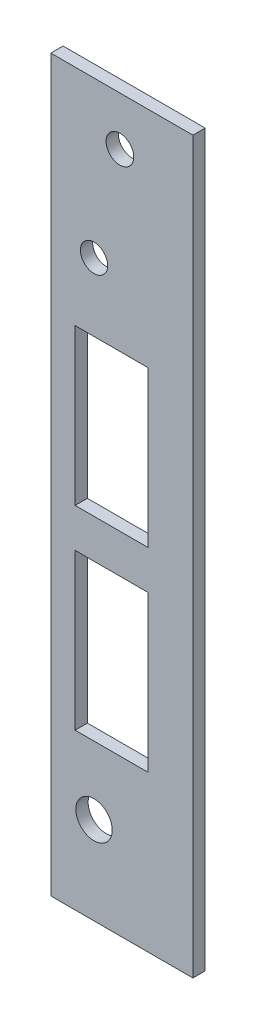
ISO-10303-21;
HEADER;
FILE_DESCRIPTION(('STEP AP214'),'2;1');
FILE_NAME('part.step','',(''),(''),'','','');
FILE_SCHEMA(('AUTOMOTIVE_DESIGN { 1 0 10303 214 1 1 1 1 }'));
ENDSEC;
DATA;
#1=APPLICATION_CONTEXT('core data for automotive mechanical design processes');
#2=APPLICATION_PROTOCOL_DEFINITION('international standard','automotive_design',2000,#1);
#3=PRODUCT_CONTEXT('',#1,'mechanical');
#4=PRODUCT('Part','Part','',(#3));
#5=PRODUCT_RELATED_PRODUCT_CATEGORY('part','',(#4));
#6=PRODUCT_DEFINITION_FORMATION('','',#4);
#7=PRODUCT_DEFINITION_CONTEXT('part definition',#1,'design');
#8=PRODUCT_DEFINITION('design','',#6,#7);
#9=PRODUCT_DEFINITION_SHAPE('','',#8);
#10=(LENGTH_UNIT() NAMED_UNIT(*) SI_UNIT(.MILLI.,.METRE.));
#11=(NAMED_UNIT(*) PLANE_ANGLE_UNIT() SI_UNIT($,.RADIAN.));
#12=(NAMED_UNIT(*) SI_UNIT($,.STERADIAN.) SOLID_ANGLE_UNIT());
#13=UNCERTAINTY_MEASURE_WITH_UNIT(LENGTH_MEASURE(1.E-05),#10,'distance_accuracy_value','');
#14=(GEOMETRIC_REPRESENTATION_CONTEXT(3) GLOBAL_UNCERTAINTY_ASSIGNED_CONTEXT((#13)) GLOBAL_UNIT_ASSIGNED_CONTEXT((#10,
#11,#12)) REPRESENTATION_CONTEXT('',''));
#15=CARTESIAN_POINT('',(0.,0.,0.));
#16=DIRECTION('',(0.,0.,1.));
#17=DIRECTION('',(1.,0.,0.));
#18=AXIS2_PLACEMENT_3D('',#15,#16,#17);
#19=CARTESIAN_POINT('',(0.,0.,1.6002));
#20=DIRECTION('',(1.,0.,0.));
#21=DIRECTION('',(0.,1.,0.));
#22=AXIS2_PLACEMENT_3D('',#19,#20,#21);
#23=PLANE('',#22);
#24=DIRECTION('',(0.,-1.,0.));
#25=VECTOR('',#24,1.);
#26=CARTESIAN_POINT('',(0.,0.,0.));
#27=LINE('',#26,#25);
#28=CARTESIAN_POINT('',(0.,0.,0.));
#29=VERTEX_POINT('',#28);
#30=CARTESIAN_POINT('',(0.,-95.25,0.));
#31=VERTEX_POINT('',#30);
#32=EDGE_CURVE('E176',#29,#31,#27,.T.);
#33=ORIENTED_EDGE('',*,*,#32,.T.);
#34=DIRECTION('',(0.,0.,-1.));
#35=VECTOR('',#34,1.);
#36=CARTESIAN_POINT('',(0.,-95.25,1.6002));
#37=LINE('',#36,#35);
#38=CARTESIAN_POINT('',(0.,-95.25,1.6002));
#39=VERTEX_POINT('',#38);
#40=EDGE_CURVE('E203',#39,#31,#37,.T.);
#41=ORIENTED_EDGE('',*,*,#40,.F.);
#42=DIRECTION('',(0.,-1.,0.));
#43=VECTOR('',#42,1.);
#44=CARTESIAN_POINT('',(0.,0.,1.6002));
#45=LINE('',#44,#43);
#46=CARTESIAN_POINT('',(0.,0.,1.6002));
#47=VERTEX_POINT('',#46);
#48=EDGE_CURVE('E185',#47,#39,#45,.T.);
#49=ORIENTED_EDGE('',*,*,#48,.F.);
#50=DIRECTION('',(0.,0.,-1.));
#51=VECTOR('',#50,1.);
#52=CARTESIAN_POINT('',(0.,0.,1.6002));
#53=LINE('',#52,#51);
#54=EDGE_CURVE('E194',#47,#29,#53,.T.);
#55=ORIENTED_EDGE('',*,*,#54,.T.);
#56=EDGE_LOOP('',(#33,#41,#49,#55));
#57=FACE_BOUND('',#56,.T.);
#58=ADVANCED_FACE('F26',(#57),#23,.F.);
#59=CARTESIAN_POINT('',(0.,-95.25,1.6002));
#60=DIRECTION('',(0.,1.,0.));
#61=DIRECTION('',(0.,0.,1.));
#62=AXIS2_PLACEMENT_3D('',#59,#60,#61);
#63=PLANE('',#62);
#64=DIRECTION('',(1.,0.,0.));
#65=VECTOR('',#64,1.);
#66=CARTESIAN_POINT('',(0.,-95.25,0.));
#67=LINE('',#66,#65);
#68=CARTESIAN_POINT('',(18.542,-95.25,0.));
#69=VERTEX_POINT('',#68);
#70=EDGE_CURVE('E179',#31,#69,#67,.T.);
#71=ORIENTED_EDGE('',*,*,#70,.T.);
#72=DIRECTION('',(0.,0.,-1.));
#73=VECTOR('',#72,1.);
#74=CARTESIAN_POINT('',(18.542,-95.25,1.6002));
#75=LINE('',#74,#73);
#76=CARTESIAN_POINT('',(18.542,-95.25,1.6002));
#77=VERTEX_POINT('',#76);
#78=EDGE_CURVE('E200',#77,#69,#75,.T.);
#79=ORIENTED_EDGE('',*,*,#78,.F.);
#80=DIRECTION('',(1.,0.,0.));
#81=VECTOR('',#80,1.);
#82=CARTESIAN_POINT('',(0.,-95.25,1.6002));
#83=LINE('',#82,#81);
#84=EDGE_CURVE('E188',#39,#77,#83,.T.);
#85=ORIENTED_EDGE('',*,*,#84,.F.);
#86=ORIENTED_EDGE('',*,*,#40,.T.);
#87=EDGE_LOOP('',(#71,#79,#85,#86));
#88=FACE_BOUND('',#87,.T.);
#89=ADVANCED_FACE('F246',(#88),#63,.F.);
#90=CARTESIAN_POINT('',(18.542,0.,1.6002));
#91=DIRECTION('',(-1.,0.,0.));
#92=DIRECTION('',(0.,-1.,0.));
#93=AXIS2_PLACEMENT_3D('',#90,#91,#92);
#94=PLANE('',#93);
#95=DIRECTION('',(0.,1.,0.));
#96=VECTOR('',#95,1.);
#97=CARTESIAN_POINT('',(18.542,0.,0.));
#98=LINE('',#97,#96);
#99=CARTESIAN_POINT('',(18.542,0.,0.));
#100=VERTEX_POINT('',#99);
#101=EDGE_CURVE('E181',#69,#100,#98,.T.);
#102=ORIENTED_EDGE('',*,*,#101,.T.);
#103=DIRECTION('',(0.,0.,-1.));
#104=VECTOR('',#103,1.);
#105=CARTESIAN_POINT('',(18.542,0.,1.6002));
#106=LINE('',#105,#104);
#107=CARTESIAN_POINT('',(18.542,0.,1.6002));
#108=VERTEX_POINT('',#107);
#109=EDGE_CURVE('E197',#108,#100,#106,.T.);
#110=ORIENTED_EDGE('',*,*,#109,.F.);
#111=DIRECTION('',(0.,1.,0.));
#112=VECTOR('',#111,1.);
#113=CARTESIAN_POINT('',(18.542,0.,1.6002));
#114=LINE('',#113,#112);
#115=EDGE_CURVE('E190',#77,#108,#114,.T.);
#116=ORIENTED_EDGE('',*,*,#115,.F.);
#117=ORIENTED_EDGE('',*,*,#78,.T.);
#118=EDGE_LOOP('',(#102,#110,#116,#117));
#119=FACE_BOUND('',#118,.T.);
#120=ADVANCED_FACE('F251',(#119),#94,.F.);
#121=CARTESIAN_POINT('',(0.,0.,1.6002));
#122=DIRECTION('',(0.,-1.,0.));
#123=DIRECTION('',(0.,0.,-1.));
#124=AXIS2_PLACEMENT_3D('',#121,#122,#123);
#125=PLANE('',#124);
#126=DIRECTION('',(-1.,0.,0.));
#127=VECTOR('',#126,1.);
#128=CARTESIAN_POINT('',(0.,0.,0.));
#129=LINE('',#128,#127);
#130=EDGE_CURVE('E183',#100,#29,#129,.T.);
#131=ORIENTED_EDGE('',*,*,#130,.T.);
#132=ORIENTED_EDGE('',*,*,#54,.F.);
#133=DIRECTION('',(-1.,0.,0.));
#134=VECTOR('',#133,1.);
#135=CARTESIAN_POINT('',(0.,0.,1.6002));
#136=LINE('',#135,#134);
#137=EDGE_CURVE('E192',#108,#47,#136,.T.);
#138=ORIENTED_EDGE('',*,*,#137,.F.);
#139=ORIENTED_EDGE('',*,*,#109,.T.);
#140=EDGE_LOOP('',(#131,#132,#138,#139));
#141=FACE_BOUND('',#140,.T.);
#142=ADVANCED_FACE('F266',(#141),#125,.F.);
#143=CARTESIAN_POINT('',(0.,-95.25,1.6002));
#144=DIRECTION('',(0.,0.,1.));
#145=DIRECTION('',(1.,0.,0.));
#146=AXIS2_PLACEMENT_3D('',#143,#144,#145);
#147=PLANE('',#146);
#148=DIRECTION('',(0.,-1.,0.));
#149=VECTOR('',#148,1.);
#150=CARTESIAN_POINT('',(3.175,-54.61,1.6002));
#151=LINE('',#150,#149);
#152=CARTESIAN_POINT('',(3.175,-54.61,1.6002));
#153=VERTEX_POINT('',#152);
#154=CARTESIAN_POINT('',(3.175,-74.93,1.6002));
#155=VERTEX_POINT('',#154);
#156=EDGE_CURVE('E40',#153,#155,#151,.T.);
#157=ORIENTED_EDGE('',*,*,#156,.F.);
#158=DIRECTION('',(-1.,0.,0.));
#159=VECTOR('',#158,1.);
#160=CARTESIAN_POINT('',(3.175,-54.61,1.6002));
#161=LINE('',#160,#159);
#162=CARTESIAN_POINT('',(12.7,-54.61,1.6002));
#163=VERTEX_POINT('',#162);
#164=EDGE_CURVE('E133',#163,#153,#161,.T.);
#165=ORIENTED_EDGE('',*,*,#164,.F.);
#166=DIRECTION('',(0.,1.,0.));
#167=VECTOR('',#166,1.);
#168=CARTESIAN_POINT('',(12.7,-54.61,1.6002));
#169=LINE('',#168,#167);
#170=CARTESIAN_POINT('',(12.7,-74.93,1.6002));
#171=VERTEX_POINT('',#170);
#172=EDGE_CURVE('E117',#171,#163,#169,.T.);
#173=ORIENTED_EDGE('',*,*,#172,.F.);
#174=DIRECTION('',(1.,0.,0.));
#175=VECTOR('',#174,1.);
#176=CARTESIAN_POINT('',(3.175,-74.93,1.6002));
#177=LINE('',#176,#175);
#178=EDGE_CURVE('E126',#155,#171,#177,.T.);
#179=ORIENTED_EDGE('',*,*,#178,.F.);
#180=EDGE_LOOP('',(#157,#165,#173,#179));
#181=FACE_BOUND('',#180,.T.);
#182=DIRECTION('',(0.,-1.,0.));
#183=VECTOR('',#182,1.);
#184=CARTESIAN_POINT('',(3.175,-29.21,1.6002));
#185=LINE('',#184,#183);
#186=CARTESIAN_POINT('',(3.175,-29.21,1.6002));
#187=VERTEX_POINT('',#186);
#188=CARTESIAN_POINT('',(3.175,-49.53,1.6002));
#189=VERTEX_POINT('',#188);
#190=EDGE_CURVE('E140',#187,#189,#185,.T.);
#191=ORIENTED_EDGE('',*,*,#190,.F.);
#192=DIRECTION('',(-1.,0.,0.));
#193=VECTOR('',#192,1.);
#194=CARTESIAN_POINT('',(3.175,-29.21,1.6002));
#195=LINE('',#194,#193);
#196=CARTESIAN_POINT('',(12.7,-29.21,1.6002));
#197=VERTEX_POINT('',#196);
#198=EDGE_CURVE('E150',#197,#187,#195,.T.);
#199=ORIENTED_EDGE('',*,*,#198,.F.);
#200=DIRECTION('',(0.,1.,0.));
#201=VECTOR('',#200,1.);
#202=CARTESIAN_POINT('',(12.7,-29.21,1.6002));
#203=LINE('',#202,#201);
#204=CARTESIAN_POINT('',(12.7,-49.53,1.6002));
#205=VERTEX_POINT('',#204);
#206=EDGE_CURVE('E147',#205,#197,#203,.T.);
#207=ORIENTED_EDGE('',*,*,#206,.F.);
#208=DIRECTION('',(1.,0.,0.));
#209=VECTOR('',#208,1.);
#210=CARTESIAN_POINT('',(3.175,-49.53,1.6002));
#211=LINE('',#210,#209);
#212=EDGE_CURVE('E144',#189,#205,#211,.T.);
#213=ORIENTED_EDGE('',*,*,#212,.F.);
#214=EDGE_LOOP('',(#191,#199,#207,#213));
#215=FACE_BOUND('',#214,.T.);
#216=CARTESIAN_POINT('',(5.63879999999999,-83.82,1.6002));
#217=DIRECTION('',(0.,0.,1.));
#218=DIRECTION('',(1.,0.,0.));
#219=AXIS2_PLACEMENT_3D('',#216,#217,#218);
#220=CIRCLE('',#219,2.3749);
#221=CARTESIAN_POINT('',(8.01369999999999,-83.82,1.6002));
#222=VERTEX_POINT('',#221);
#223=EDGE_CURVE('E156',#222,#222,#220,.T.);
#224=ORIENTED_EDGE('',*,*,#223,.F.);
#225=EDGE_LOOP('',(#224));
#226=FACE_BOUND('',#225,.T.);
#227=CARTESIAN_POINT('',(5.6388,-20.32,1.6002));
#228=DIRECTION('',(0.,0.,1.));
#229=DIRECTION('',(1.,0.,0.));
#230=AXIS2_PLACEMENT_3D('',#227,#228,#229);
#231=CIRCLE('',#230,1.778);
#232=CARTESIAN_POINT('',(7.4168,-20.32,1.6002));
#233=VERTEX_POINT('',#232);
#234=EDGE_CURVE('E166',#233,#233,#231,.T.);
#235=ORIENTED_EDGE('',*,*,#234,.F.);
#236=EDGE_LOOP('',(#235));
#237=FACE_BOUND('',#236,.T.);
#238=CARTESIAN_POINT('',(9.01700000000001,-6.34999999999999,1.6002));
#239=DIRECTION('',(0.,0.,1.));
#240=DIRECTION('',(1.,0.,0.));
#241=AXIS2_PLACEMENT_3D('',#238,#239,#240);
#242=CIRCLE('',#241,1.8034);
#243=CARTESIAN_POINT('',(10.8204,-6.34999999999999,1.6002));
#244=VERTEX_POINT('',#243);
#245=EDGE_CURVE('E170',#244,#244,#242,.T.);
#246=ORIENTED_EDGE('',*,*,#245,.F.);
#247=EDGE_LOOP('',(#246));
#248=FACE_BOUND('',#247,.T.);
#249=ORIENTED_EDGE('',*,*,#48,.T.);
#250=ORIENTED_EDGE('',*,*,#84,.T.);
#251=ORIENTED_EDGE('',*,*,#115,.T.);
#252=ORIENTED_EDGE('',*,*,#137,.T.);
#253=EDGE_LOOP('',(#249,#250,#251,#252));
#254=FACE_BOUND('',#253,.T.);
#255=ADVANCED_FACE('F130',(#181,#215,#226,#237,#248,#254),#147,.T.);
#256=CARTESIAN_POINT('',(0.,-95.25,0.));
#257=DIRECTION('',(0.,0.,1.));
#258=DIRECTION('',(1.,0.,0.));
#259=AXIS2_PLACEMENT_3D('',#256,#257,#258);
#260=PLANE('',#259);
#261=DIRECTION('',(-1.,0.,0.));
#262=VECTOR('',#261,1.);
#263=CARTESIAN_POINT('',(0.,-54.61,0.));
#264=LINE('',#263,#262);
#265=CARTESIAN_POINT('',(12.7,-54.61,0.));
#266=VERTEX_POINT('',#265);
#267=CARTESIAN_POINT('',(3.175,-54.61,0.));
#268=VERTEX_POINT('',#267);
#269=EDGE_CURVE('E33',#266,#268,#264,.T.);
#270=ORIENTED_EDGE('',*,*,#269,.T.);
#271=DIRECTION('',(0.,-1.,0.));
#272=VECTOR('',#271,1.);
#273=CARTESIAN_POINT('',(3.175,-95.25,0.));
#274=LINE('',#273,#272);
#275=CARTESIAN_POINT('',(3.175,-74.93,0.));
#276=VERTEX_POINT('',#275);
#277=EDGE_CURVE('E11',#268,#276,#274,.T.);
#278=ORIENTED_EDGE('',*,*,#277,.T.);
#279=DIRECTION('',(1.,0.,0.));
#280=VECTOR('',#279,1.);
#281=CARTESIAN_POINT('',(0.,-74.93,0.));
#282=LINE('',#281,#280);
#283=CARTESIAN_POINT('',(12.7,-74.93,0.));
#284=VERTEX_POINT('',#283);
#285=EDGE_CURVE('E222',#276,#284,#282,.T.);
#286=ORIENTED_EDGE('',*,*,#285,.T.);
#287=DIRECTION('',(0.,1.,0.));
#288=VECTOR('',#287,1.);
#289=CARTESIAN_POINT('',(12.7,-95.25,0.));
#290=LINE('',#289,#288);
#291=EDGE_CURVE('E120',#284,#266,#290,.T.);
#292=ORIENTED_EDGE('',*,*,#291,.T.);
#293=EDGE_LOOP('',(#270,#278,#286,#292));
#294=FACE_BOUND('',#293,.T.);
#295=DIRECTION('',(-1.,0.,0.));
#296=VECTOR('',#295,1.);
#297=CARTESIAN_POINT('',(0.,-29.21,0.));
#298=LINE('',#297,#296);
#299=CARTESIAN_POINT('',(12.7,-29.21,0.));
#300=VERTEX_POINT('',#299);
#301=CARTESIAN_POINT('',(3.175,-29.21,0.));
#302=VERTEX_POINT('',#301);
#303=EDGE_CURVE('E216',#300,#302,#298,.T.);
#304=ORIENTED_EDGE('',*,*,#303,.T.);
#305=DIRECTION('',(0.,-1.,0.));
#306=VECTOR('',#305,1.);
#307=CARTESIAN_POINT('',(3.17500000000001,-95.25,0.));
#308=LINE('',#307,#306);
#309=CARTESIAN_POINT('',(3.175,-49.53,0.));
#310=VERTEX_POINT('',#309);
#311=EDGE_CURVE('E219',#302,#310,#308,.T.);
#312=ORIENTED_EDGE('',*,*,#311,.T.);
#313=DIRECTION('',(1.,0.,0.));
#314=VECTOR('',#313,1.);
#315=CARTESIAN_POINT('',(0.,-49.53,0.));
#316=LINE('',#315,#314);
#317=CARTESIAN_POINT('',(12.7,-49.53,0.));
#318=VERTEX_POINT('',#317);
#319=EDGE_CURVE('E206',#310,#318,#316,.T.);
#320=ORIENTED_EDGE('',*,*,#319,.T.);
#321=DIRECTION('',(0.,1.,0.));
#322=VECTOR('',#321,1.);
#323=CARTESIAN_POINT('',(12.7,-95.25,0.));
#324=LINE('',#323,#322);
#325=EDGE_CURVE('E213',#318,#300,#324,.T.);
#326=ORIENTED_EDGE('',*,*,#325,.T.);
#327=EDGE_LOOP('',(#304,#312,#320,#326));
#328=FACE_BOUND('',#327,.T.);
#329=CARTESIAN_POINT('',(5.63879999999999,-83.82,0.));
#330=DIRECTION('',(0.,0.,1.));
#331=DIRECTION('',(1.,0.,0.));
#332=AXIS2_PLACEMENT_3D('',#329,#330,#331);
#333=CIRCLE('',#332,2.3749);
#334=CARTESIAN_POINT('',(8.01369999999999,-83.82,0.));
#335=VERTEX_POINT('',#334);
#336=EDGE_CURVE('E165',#335,#335,#333,.T.);
#337=ORIENTED_EDGE('',*,*,#336,.T.);
#338=EDGE_LOOP('',(#337));
#339=FACE_BOUND('',#338,.T.);
#340=CARTESIAN_POINT('',(5.6388,-20.32,0.));
#341=DIRECTION('',(0.,0.,1.));
#342=DIRECTION('',(1.,0.,0.));
#343=AXIS2_PLACEMENT_3D('',#340,#341,#342);
#344=CIRCLE('',#343,1.778);
#345=CARTESIAN_POINT('',(7.4168,-20.32,0.));
#346=VERTEX_POINT('',#345);
#347=EDGE_CURVE('E169',#346,#346,#344,.T.);
#348=ORIENTED_EDGE('',*,*,#347,.T.);
#349=EDGE_LOOP('',(#348));
#350=FACE_BOUND('',#349,.T.);
#351=CARTESIAN_POINT('',(9.01700000000001,-6.34999999999999,0.));
#352=DIRECTION('',(0.,0.,1.));
#353=DIRECTION('',(1.,0.,0.));
#354=AXIS2_PLACEMENT_3D('',#351,#352,#353);
#355=CIRCLE('',#354,1.8034);
#356=CARTESIAN_POINT('',(10.8204,-6.34999999999999,0.));
#357=VERTEX_POINT('',#356);
#358=EDGE_CURVE('E173',#357,#357,#355,.T.);
#359=ORIENTED_EDGE('',*,*,#358,.T.);
#360=EDGE_LOOP('',(#359));
#361=FACE_BOUND('',#360,.T.);
#362=ORIENTED_EDGE('',*,*,#32,.F.);
#363=ORIENTED_EDGE('',*,*,#130,.F.);
#364=ORIENTED_EDGE('',*,*,#101,.F.);
#365=ORIENTED_EDGE('',*,*,#70,.F.);
#366=EDGE_LOOP('',(#362,#363,#364,#365));
#367=FACE_BOUND('',#366,.T.);
#368=ADVANCED_FACE('F226',(#294,#328,#339,#350,#361,#367),#260,.F.);
#369=CARTESIAN_POINT('',(9.01700000000001,-6.34999999999999,0.));
#370=DIRECTION('',(0.,0.,1.));
#371=DIRECTION('',(1.,0.,0.));
#372=AXIS2_PLACEMENT_3D('',#369,#370,#371);
#373=CYLINDRICAL_SURFACE('',#372,1.8034);
#374=ORIENTED_EDGE('',*,*,#358,.F.);
#375=EDGE_LOOP('',(#374));
#376=FACE_BOUND('',#375,.T.);
#377=ORIENTED_EDGE('',*,*,#245,.T.);
#378=EDGE_LOOP('',(#377));
#379=FACE_BOUND('',#378,.T.);
#380=ADVANCED_FACE('F279',(#376,#379),#373,.F.);
#381=CARTESIAN_POINT('',(5.6388,-20.32,-0.9398));
#382=DIRECTION('',(0.,0.,1.));
#383=DIRECTION('',(1.,0.,0.));
#384=AXIS2_PLACEMENT_3D('',#381,#382,#383);
#385=CYLINDRICAL_SURFACE('',#384,1.778);
#386=ORIENTED_EDGE('',*,*,#234,.T.);
#387=EDGE_LOOP('',(#386));
#388=FACE_BOUND('',#387,.T.);
#389=ORIENTED_EDGE('',*,*,#347,.F.);
#390=EDGE_LOOP('',(#389));
#391=FACE_BOUND('',#390,.T.);
#392=ADVANCED_FACE('F282',(#388,#391),#385,.F.);
#393=CARTESIAN_POINT('',(5.63879999999999,-83.82,-0.9398));
#394=DIRECTION('',(0.,0.,1.));
#395=DIRECTION('',(1.,0.,0.));
#396=AXIS2_PLACEMENT_3D('',#393,#394,#395);
#397=CYLINDRICAL_SURFACE('',#396,2.3749);
#398=ORIENTED_EDGE('',*,*,#223,.T.);
#399=EDGE_LOOP('',(#398));
#400=FACE_BOUND('',#399,.T.);
#401=ORIENTED_EDGE('',*,*,#336,.F.);
#402=EDGE_LOOP('',(#401));
#403=FACE_BOUND('',#402,.T.);
#404=ADVANCED_FACE('F286',(#400,#403),#397,.F.);
#405=CARTESIAN_POINT('',(3.175,-29.21,-0.9398));
#406=DIRECTION('',(-1.,0.,0.));
#407=DIRECTION('',(0.,-1.,0.));
#408=AXIS2_PLACEMENT_3D('',#405,#406,#407);
#409=PLANE('',#408);
#410=DIRECTION('',(0.,0.,1.));
#411=VECTOR('',#410,1.);
#412=CARTESIAN_POINT('',(3.175,-29.21,-0.9398));
#413=LINE('',#412,#411);
#414=EDGE_CURVE('E154',#302,#187,#413,.T.);
#415=ORIENTED_EDGE('',*,*,#414,.T.);
#416=ORIENTED_EDGE('',*,*,#190,.T.);
#417=DIRECTION('',(0.,0.,1.));
#418=VECTOR('',#417,1.);
#419=CARTESIAN_POINT('',(3.175,-49.53,-0.9398));
#420=LINE('',#419,#418);
#421=EDGE_CURVE('E153',#310,#189,#420,.T.);
#422=ORIENTED_EDGE('',*,*,#421,.F.);
#423=ORIENTED_EDGE('',*,*,#311,.F.);
#424=EDGE_LOOP('',(#415,#416,#422,#423));
#425=FACE_BOUND('',#424,.T.);
#426=ADVANCED_FACE('F290',(#425),#409,.F.);
#427=CARTESIAN_POINT('',(3.175,-29.21,-0.9398));
#428=DIRECTION('',(0.,1.,0.));
#429=DIRECTION('',(0.,0.,1.));
#430=AXIS2_PLACEMENT_3D('',#427,#428,#429);
#431=PLANE('',#430);
#432=DIRECTION('',(0.,0.,1.));
#433=VECTOR('',#432,1.);
#434=CARTESIAN_POINT('',(12.7,-29.21,-0.9398));
#435=LINE('',#434,#433);
#436=EDGE_CURVE('E157',#300,#197,#435,.T.);
#437=ORIENTED_EDGE('',*,*,#436,.T.);
#438=ORIENTED_EDGE('',*,*,#198,.T.);
#439=ORIENTED_EDGE('',*,*,#414,.F.);
#440=ORIENTED_EDGE('',*,*,#303,.F.);
#441=EDGE_LOOP('',(#437,#438,#439,#440));
#442=FACE_BOUND('',#441,.T.);
#443=ADVANCED_FACE('F293',(#442),#431,.F.);
#444=CARTESIAN_POINT('',(12.7,-29.21,-0.9398));
#445=DIRECTION('',(1.,0.,0.));
#446=DIRECTION('',(0.,1.,0.));
#447=AXIS2_PLACEMENT_3D('',#444,#445,#446);
#448=PLANE('',#447);
#449=DIRECTION('',(0.,0.,1.));
#450=VECTOR('',#449,1.);
#451=CARTESIAN_POINT('',(12.7,-49.53,-0.9398));
#452=LINE('',#451,#450);
#453=EDGE_CURVE('E159',#318,#205,#452,.T.);
#454=ORIENTED_EDGE('',*,*,#453,.T.);
#455=ORIENTED_EDGE('',*,*,#206,.T.);
#456=ORIENTED_EDGE('',*,*,#436,.F.);
#457=ORIENTED_EDGE('',*,*,#325,.F.);
#458=EDGE_LOOP('',(#454,#455,#456,#457));
#459=FACE_BOUND('',#458,.T.);
#460=ADVANCED_FACE('F240',(#459),#448,.F.);
#461=CARTESIAN_POINT('',(3.175,-49.53,-0.9398));
#462=DIRECTION('',(0.,-1.,0.));
#463=DIRECTION('',(0.,0.,-1.));
#464=AXIS2_PLACEMENT_3D('',#461,#462,#463);
#465=PLANE('',#464);
#466=ORIENTED_EDGE('',*,*,#421,.T.);
#467=ORIENTED_EDGE('',*,*,#212,.T.);
#468=ORIENTED_EDGE('',*,*,#453,.F.);
#469=ORIENTED_EDGE('',*,*,#319,.F.);
#470=EDGE_LOOP('',(#466,#467,#468,#469));
#471=FACE_BOUND('',#470,.T.);
#472=ADVANCED_FACE('F233',(#471),#465,.F.);
#473=CARTESIAN_POINT('',(3.175,-54.61,-0.9398));
#474=DIRECTION('',(-1.,0.,0.));
#475=DIRECTION('',(0.,-1.,0.));
#476=AXIS2_PLACEMENT_3D('',#473,#474,#475);
#477=PLANE('',#476);
#478=DIRECTION('',(0.,0.,1.));
#479=VECTOR('',#478,1.);
#480=CARTESIAN_POINT('',(3.175,-54.61,-0.9398));
#481=LINE('',#480,#479);
#482=EDGE_CURVE('E138',#268,#153,#481,.T.);
#483=ORIENTED_EDGE('',*,*,#482,.T.);
#484=ORIENTED_EDGE('',*,*,#156,.T.);
#485=DIRECTION('',(0.,0.,1.));
#486=VECTOR('',#485,1.);
#487=CARTESIAN_POINT('',(3.175,-74.93,-0.9398));
#488=LINE('',#487,#486);
#489=EDGE_CURVE('E123',#276,#155,#488,.T.);
#490=ORIENTED_EDGE('',*,*,#489,.F.);
#491=ORIENTED_EDGE('',*,*,#277,.F.);
#492=EDGE_LOOP('',(#483,#484,#490,#491));
#493=FACE_BOUND('',#492,.T.);
#494=ADVANCED_FACE('F231',(#493),#477,.F.);
#495=CARTESIAN_POINT('',(3.175,-54.61,-0.9398));
#496=DIRECTION('',(0.,1.,0.));
#497=DIRECTION('',(0.,0.,1.));
#498=AXIS2_PLACEMENT_3D('',#495,#496,#497);
#499=PLANE('',#498);
#500=DIRECTION('',(0.,0.,1.));
#501=VECTOR('',#500,1.);
#502=CARTESIAN_POINT('',(12.7,-54.61,-0.9398));
#503=LINE('',#502,#501);
#504=EDGE_CURVE('E122',#266,#163,#503,.T.);
#505=ORIENTED_EDGE('',*,*,#504,.T.);
#506=ORIENTED_EDGE('',*,*,#164,.T.);
#507=ORIENTED_EDGE('',*,*,#482,.F.);
#508=ORIENTED_EDGE('',*,*,#269,.F.);
#509=EDGE_LOOP('',(#505,#506,#507,#508));
#510=FACE_BOUND('',#509,.T.);
#511=ADVANCED_FACE('F230',(#510),#499,.F.);
#512=CARTESIAN_POINT('',(12.7,-54.61,-0.9398));
#513=DIRECTION('',(1.,0.,0.));
#514=DIRECTION('',(0.,0.,-1.));
#515=AXIS2_PLACEMENT_3D('',#512,#513,#514);
#516=PLANE('',#515);
#517=DIRECTION('',(0.,0.,1.));
#518=VECTOR('',#517,1.);
#519=CARTESIAN_POINT('',(12.7,-74.93,-0.9398));
#520=LINE('',#519,#518);
#521=EDGE_CURVE('E48',#284,#171,#520,.T.);
#522=ORIENTED_EDGE('',*,*,#521,.T.);
#523=ORIENTED_EDGE('',*,*,#172,.T.);
#524=ORIENTED_EDGE('',*,*,#504,.F.);
#525=ORIENTED_EDGE('',*,*,#291,.F.);
#526=EDGE_LOOP('',(#522,#523,#524,#525));
#527=FACE_BOUND('',#526,.T.);
#528=ADVANCED_FACE('F114',(#527),#516,.F.);
#529=CARTESIAN_POINT('',(3.175,-74.93,-0.9398));
#530=DIRECTION('',(0.,-1.,0.));
#531=DIRECTION('',(0.,0.,-1.));
#532=AXIS2_PLACEMENT_3D('',#529,#530,#531);
#533=PLANE('',#532);
#534=ORIENTED_EDGE('',*,*,#489,.T.);
#535=ORIENTED_EDGE('',*,*,#178,.T.);
#536=ORIENTED_EDGE('',*,*,#521,.F.);
#537=ORIENTED_EDGE('',*,*,#285,.F.);
#538=EDGE_LOOP('',(#534,#535,#536,#537));
#539=FACE_BOUND('',#538,.T.);
#540=ADVANCED_FACE('F127',(#539),#533,.F.);
#541=CLOSED_SHELL('',(#58,#89,#120,#142,#255,#368,#380,#392,#404,#426,#443,#460,#472,#494,#511,
#528,#540));
#542=MANIFOLD_SOLID_BREP('B2',#541);
#543=ADVANCED_BREP_SHAPE_REPRESENTATION('',(#18,#542),#14);
#544=SHAPE_DEFINITION_REPRESENTATION(#9,#543);
ENDSEC;
END-ISO-10303-21;
